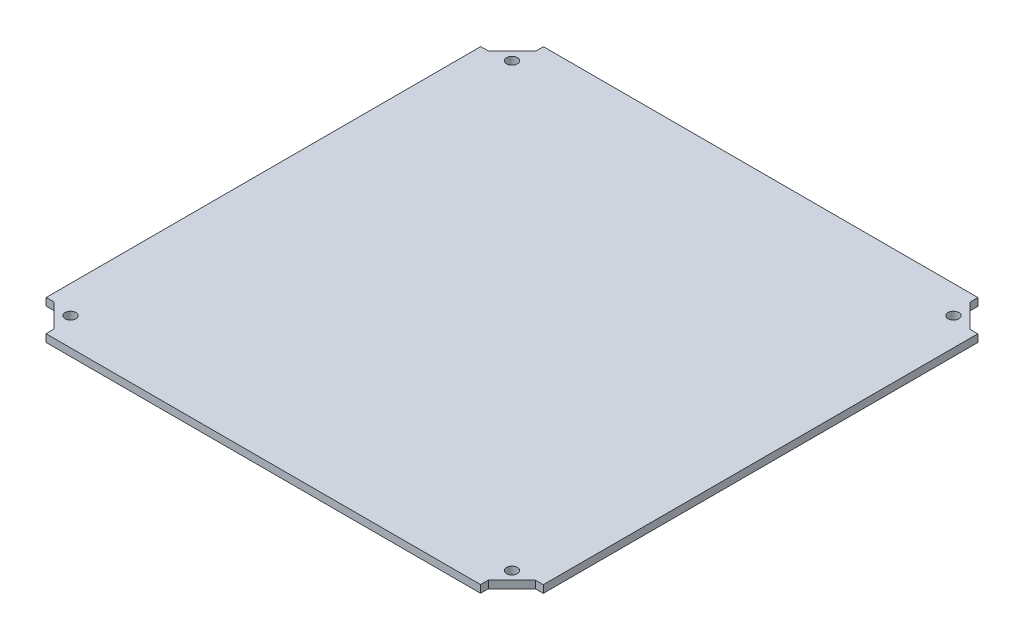
ISO-10303-21;
HEADER;
FILE_DESCRIPTION(('STEP AP214'),'2;1');
FILE_NAME('part.step','',(''),(''),'','','');
FILE_SCHEMA(('AUTOMOTIVE_DESIGN { 1 0 10303 214 1 1 1 1 }'));
ENDSEC;
DATA;
#1=APPLICATION_CONTEXT('core data for automotive mechanical design processes');
#2=APPLICATION_PROTOCOL_DEFINITION('international standard','automotive_design',2000,#1);
#3=PRODUCT_CONTEXT('',#1,'mechanical');
#4=PRODUCT('Part','Part','',(#3));
#5=PRODUCT_RELATED_PRODUCT_CATEGORY('part','',(#4));
#6=PRODUCT_DEFINITION_FORMATION('','',#4);
#7=PRODUCT_DEFINITION_CONTEXT('part definition',#1,'design');
#8=PRODUCT_DEFINITION('design','',#6,#7);
#9=PRODUCT_DEFINITION_SHAPE('','',#8);
#10=(LENGTH_UNIT() NAMED_UNIT(*) SI_UNIT(.MILLI.,.METRE.));
#11=(NAMED_UNIT(*) PLANE_ANGLE_UNIT() SI_UNIT($,.RADIAN.));
#12=(NAMED_UNIT(*) SI_UNIT($,.STERADIAN.) SOLID_ANGLE_UNIT());
#13=UNCERTAINTY_MEASURE_WITH_UNIT(LENGTH_MEASURE(1.E-05),#10,'distance_accuracy_value','');
#14=(GEOMETRIC_REPRESENTATION_CONTEXT(3) GLOBAL_UNCERTAINTY_ASSIGNED_CONTEXT((#13)) GLOBAL_UNIT_ASSIGNED_CONTEXT((#10,
#11,#12)) REPRESENTATION_CONTEXT('',''));
#15=CARTESIAN_POINT('',(0.,0.,0.));
#16=DIRECTION('',(0.,0.,1.));
#17=DIRECTION('',(1.,0.,0.));
#18=AXIS2_PLACEMENT_3D('',#15,#16,#17);
#19=CARTESIAN_POINT('',(0.,3.175,91.2332677458592));
#20=DIRECTION('',(0.,0.,-1.));
#21=DIRECTION('',(-1.,0.,0.));
#22=AXIS2_PLACEMENT_3D('',#19,#20,#21);
#23=PLANE('',#22);
#24=DIRECTION('',(1.,0.,0.));
#25=VECTOR('',#24,1.);
#26=CARTESIAN_POINT('',(0.,0.,91.2332677458592));
#27=LINE('',#26,#25);
#28=CARTESIAN_POINT('',(-104.4575,0.,91.2332677458592));
#29=VERTEX_POINT('',#28);
#30=CARTESIAN_POINT('',(-101.1555,0.,91.2332677458592));
#31=VERTEX_POINT('',#30);
#32=EDGE_CURVE('E191',#29,#31,#27,.T.);
#33=ORIENTED_EDGE('',*,*,#32,.T.);
#34=DIRECTION('',(0.,-1.,0.));
#35=VECTOR('',#34,1.);
#36=CARTESIAN_POINT('',(-101.1555,3.175,91.2332677458592));
#37=LINE('',#36,#35);
#38=CARTESIAN_POINT('',(-101.1555,3.175,91.2332677458592));
#39=VERTEX_POINT('',#38);
#40=EDGE_CURVE('E11',#39,#31,#37,.T.);
#41=ORIENTED_EDGE('',*,*,#40,.F.);
#42=DIRECTION('',(1.,0.,0.));
#43=VECTOR('',#42,1.);
#44=CARTESIAN_POINT('',(0.,3.175,91.2332677458592));
#45=LINE('',#44,#43);
#46=CARTESIAN_POINT('',(-104.4575,3.175,91.2332677458592));
#47=VERTEX_POINT('',#46);
#48=EDGE_CURVE('E249',#47,#39,#45,.T.);
#49=ORIENTED_EDGE('',*,*,#48,.F.);
#50=DIRECTION('',(0.,-1.,0.));
#51=VECTOR('',#50,1.);
#52=CARTESIAN_POINT('',(-104.4575,3.175,91.2332677458592));
#53=LINE('',#52,#51);
#54=EDGE_CURVE('E58',#47,#29,#53,.T.);
#55=ORIENTED_EDGE('',*,*,#54,.T.);
#56=EDGE_LOOP('',(#33,#41,#49,#55));
#57=FACE_BOUND('',#56,.T.);
#58=ADVANCED_FACE('F41',(#57),#23,.F.);
#59=CARTESIAN_POINT('',(-96.6436327647906,3.175,95.7855537941316));
#60=DIRECTION('',(0.710252845679373,0.,-0.703946656504847));
#61=DIRECTION('',(-0.703946656504847,0.,-0.710252845679373));
#62=AXIS2_PLACEMENT_3D('',#59,#60,#61);
#63=PLANE('',#62);
#64=DIRECTION('',(0.703946656504847,0.,0.710252845679373));
#65=VECTOR('',#64,1.);
#66=CARTESIAN_POINT('',(-96.6436327647906,0.,95.7855537941316));
#67=LINE('',#66,#65);
#68=CARTESIAN_POINT('',(-91.3213652086273,0.,101.1555));
#69=VERTEX_POINT('',#68);
#70=EDGE_CURVE('E194',#31,#69,#67,.T.);
#71=ORIENTED_EDGE('',*,*,#70,.T.);
#72=DIRECTION('',(0.,-1.,0.));
#73=VECTOR('',#72,1.);
#74=CARTESIAN_POINT('',(-91.3213652086273,3.175,101.1555));
#75=LINE('',#74,#73);
#76=CARTESIAN_POINT('',(-91.3213652086273,3.175,101.1555));
#77=VERTEX_POINT('',#76);
#78=EDGE_CURVE('E50',#77,#69,#75,.T.);
#79=ORIENTED_EDGE('',*,*,#78,.F.);
#80=DIRECTION('',(0.703946656504847,0.,0.710252845679373));
#81=VECTOR('',#80,1.);
#82=CARTESIAN_POINT('',(-96.6436327647906,3.175,95.7855537941316));
#83=LINE('',#82,#81);
#84=EDGE_CURVE('E120',#39,#77,#83,.T.);
#85=ORIENTED_EDGE('',*,*,#84,.F.);
#86=ORIENTED_EDGE('',*,*,#40,.T.);
#87=EDGE_LOOP('',(#71,#79,#85,#86));
#88=FACE_BOUND('',#87,.T.);
#89=ADVANCED_FACE('F295',(#88),#63,.F.);
#90=CARTESIAN_POINT('',(-91.3213652086273,3.175,0.));
#91=DIRECTION('',(-1.,0.,0.));
#92=DIRECTION('',(0.,0.,1.));
#93=AXIS2_PLACEMENT_3D('',#90,#91,#92);
#94=PLANE('',#93);
#95=DIRECTION('',(0.,0.,-1.));
#96=VECTOR('',#95,1.);
#97=CARTESIAN_POINT('',(-91.3213652086273,0.,0.));
#98=LINE('',#97,#96);
#99=CARTESIAN_POINT('',(-91.3213652086273,0.,104.4575));
#100=VERTEX_POINT('',#99);
#101=EDGE_CURVE('E199',#100,#69,#98,.T.);
#102=ORIENTED_EDGE('',*,*,#101,.F.);
#103=DIRECTION('',(0.,-1.,0.));
#104=VECTOR('',#103,1.);
#105=CARTESIAN_POINT('',(-91.3213652086273,3.175,104.4575));
#106=LINE('',#105,#104);
#107=CARTESIAN_POINT('',(-91.3213652086273,3.175,104.4575));
#108=VERTEX_POINT('',#107);
#109=EDGE_CURVE('E286',#108,#100,#106,.T.);
#110=ORIENTED_EDGE('',*,*,#109,.F.);
#111=DIRECTION('',(0.,0.,-1.));
#112=VECTOR('',#111,1.);
#113=CARTESIAN_POINT('',(-91.3213652086273,3.175,0.));
#114=LINE('',#113,#112);
#115=EDGE_CURVE('E294',#108,#77,#114,.T.);
#116=ORIENTED_EDGE('',*,*,#115,.T.);
#117=ORIENTED_EDGE('',*,*,#78,.T.);
#118=EDGE_LOOP('',(#102,#110,#116,#117));
#119=FACE_BOUND('',#118,.T.);
#120=ADVANCED_FACE('F292',(#119),#94,.T.);
#121=CARTESIAN_POINT('',(0.,3.175,104.4575));
#122=DIRECTION('',(0.,0.,-1.));
#123=DIRECTION('',(-1.,0.,0.));
#124=AXIS2_PLACEMENT_3D('',#121,#122,#123);
#125=PLANE('',#124);
#126=DIRECTION('',(1.,0.,0.));
#127=VECTOR('',#126,1.);
#128=CARTESIAN_POINT('',(0.,0.,104.4575));
#129=LINE('',#128,#127);
#130=CARTESIAN_POINT('',(91.2332677458592,0.,104.4575));
#131=VERTEX_POINT('',#130);
#132=EDGE_CURVE('E203',#100,#131,#129,.T.);
#133=ORIENTED_EDGE('',*,*,#132,.T.);
#134=DIRECTION('',(0.,-1.,0.));
#135=VECTOR('',#134,1.);
#136=CARTESIAN_POINT('',(91.2332677458592,3.175,104.4575));
#137=LINE('',#136,#135);
#138=CARTESIAN_POINT('',(91.2332677458592,3.175,104.4575));
#139=VERTEX_POINT('',#138);
#140=EDGE_CURVE('E282',#139,#131,#137,.T.);
#141=ORIENTED_EDGE('',*,*,#140,.F.);
#142=DIRECTION('',(1.,0.,0.));
#143=VECTOR('',#142,1.);
#144=CARTESIAN_POINT('',(0.,3.175,104.4575));
#145=LINE('',#144,#143);
#146=EDGE_CURVE('E314',#108,#139,#145,.T.);
#147=ORIENTED_EDGE('',*,*,#146,.F.);
#148=ORIENTED_EDGE('',*,*,#109,.T.);
#149=EDGE_LOOP('',(#133,#141,#147,#148));
#150=FACE_BOUND('',#149,.T.);
#151=ADVANCED_FACE('F304',(#150),#125,.F.);
#152=CARTESIAN_POINT('',(91.2332677458592,3.175,0.));
#153=DIRECTION('',(-1.,0.,0.));
#154=DIRECTION('',(0.,0.,1.));
#155=AXIS2_PLACEMENT_3D('',#152,#153,#154);
#156=PLANE('',#155);
#157=DIRECTION('',(0.,0.,-1.));
#158=VECTOR('',#157,1.);
#159=CARTESIAN_POINT('',(91.2332677458592,0.,0.));
#160=LINE('',#159,#158);
#161=CARTESIAN_POINT('',(91.2332677458592,0.,101.1555));
#162=VERTEX_POINT('',#161);
#163=EDGE_CURVE('E206',#131,#162,#160,.T.);
#164=ORIENTED_EDGE('',*,*,#163,.T.);
#165=DIRECTION('',(0.,-1.,0.));
#166=VECTOR('',#165,1.);
#167=CARTESIAN_POINT('',(91.2332677458592,3.175,101.1555));
#168=LINE('',#167,#166);
#169=CARTESIAN_POINT('',(91.2332677458592,3.175,101.1555));
#170=VERTEX_POINT('',#169);
#171=EDGE_CURVE('E278',#170,#162,#168,.T.);
#172=ORIENTED_EDGE('',*,*,#171,.F.);
#173=DIRECTION('',(0.,0.,-1.));
#174=VECTOR('',#173,1.);
#175=CARTESIAN_POINT('',(91.2332677458592,3.175,0.));
#176=LINE('',#175,#174);
#177=EDGE_CURVE('E310',#139,#170,#176,.T.);
#178=ORIENTED_EDGE('',*,*,#177,.F.);
#179=ORIENTED_EDGE('',*,*,#140,.T.);
#180=EDGE_LOOP('',(#164,#172,#178,#179));
#181=FACE_BOUND('',#180,.T.);
#182=ADVANCED_FACE('F308',(#181),#156,.F.);
#183=CARTESIAN_POINT('',(95.7855537941315,3.175,96.6436327647906));
#184=DIRECTION('',(-0.703946656504847,0.,-0.710252845679373));
#185=DIRECTION('',(-0.710252845679373,0.,0.703946656504847));
#186=AXIS2_PLACEMENT_3D('',#183,#184,#185);
#187=PLANE('',#186);
#188=DIRECTION('',(0.710252845679373,0.,-0.703946656504847));
#189=VECTOR('',#188,1.);
#190=CARTESIAN_POINT('',(95.7855537941315,0.,96.6436327647906));
#191=LINE('',#190,#189);
#192=CARTESIAN_POINT('',(101.1555,0.,91.3213652086273));
#193=VERTEX_POINT('',#192);
#194=EDGE_CURVE('E209',#162,#193,#191,.T.);
#195=ORIENTED_EDGE('',*,*,#194,.T.);
#196=DIRECTION('',(0.,-1.,0.));
#197=VECTOR('',#196,1.);
#198=CARTESIAN_POINT('',(101.1555,3.175,91.3213652086273));
#199=LINE('',#198,#197);
#200=CARTESIAN_POINT('',(101.1555,3.175,91.3213652086273));
#201=VERTEX_POINT('',#200);
#202=EDGE_CURVE('E275',#201,#193,#199,.T.);
#203=ORIENTED_EDGE('',*,*,#202,.F.);
#204=DIRECTION('',(0.710252845679373,0.,-0.703946656504847));
#205=VECTOR('',#204,1.);
#206=CARTESIAN_POINT('',(95.7855537941315,3.175,96.6436327647906));
#207=LINE('',#206,#205);
#208=EDGE_CURVE('E313',#170,#201,#207,.T.);
#209=ORIENTED_EDGE('',*,*,#208,.F.);
#210=ORIENTED_EDGE('',*,*,#171,.T.);
#211=EDGE_LOOP('',(#195,#203,#209,#210));
#212=FACE_BOUND('',#211,.T.);
#213=ADVANCED_FACE('F564',(#212),#187,.F.);
#214=CARTESIAN_POINT('',(0.,3.175,91.3213652086273));
#215=DIRECTION('',(0.,0.,1.));
#216=DIRECTION('',(1.,0.,0.));
#217=AXIS2_PLACEMENT_3D('',#214,#215,#216);
#218=PLANE('',#217);
#219=DIRECTION('',(-1.,0.,0.));
#220=VECTOR('',#219,1.);
#221=CARTESIAN_POINT('',(0.,0.,91.3213652086273));
#222=LINE('',#221,#220);
#223=CARTESIAN_POINT('',(104.4575,0.,91.3213652086273));
#224=VERTEX_POINT('',#223);
#225=EDGE_CURVE('E213',#224,#193,#222,.T.);
#226=ORIENTED_EDGE('',*,*,#225,.F.);
#227=DIRECTION('',(0.,-1.,0.));
#228=VECTOR('',#227,1.);
#229=CARTESIAN_POINT('',(104.4575,3.175,91.3213652086273));
#230=LINE('',#229,#228);
#231=CARTESIAN_POINT('',(104.4575,3.175,91.3213652086273));
#232=VERTEX_POINT('',#231);
#233=EDGE_CURVE('E272',#232,#224,#230,.T.);
#234=ORIENTED_EDGE('',*,*,#233,.F.);
#235=DIRECTION('',(-1.,0.,0.));
#236=VECTOR('',#235,1.);
#237=CARTESIAN_POINT('',(0.,3.175,91.3213652086273));
#238=LINE('',#237,#236);
#239=EDGE_CURVE('E318',#232,#201,#238,.T.);
#240=ORIENTED_EDGE('',*,*,#239,.T.);
#241=ORIENTED_EDGE('',*,*,#202,.T.);
#242=EDGE_LOOP('',(#226,#234,#240,#241));
#243=FACE_BOUND('',#242,.T.);
#244=ADVANCED_FACE('F554',(#243),#218,.T.);
#245=CARTESIAN_POINT('',(104.4575,3.175,0.));
#246=DIRECTION('',(-1.,0.,0.));
#247=DIRECTION('',(0.,0.,1.));
#248=AXIS2_PLACEMENT_3D('',#245,#246,#247);
#249=PLANE('',#248);
#250=DIRECTION('',(0.,0.,-1.));
#251=VECTOR('',#250,1.);
#252=CARTESIAN_POINT('',(104.4575,0.,0.));
#253=LINE('',#252,#251);
#254=CARTESIAN_POINT('',(104.4575,0.,-91.2332677458592));
#255=VERTEX_POINT('',#254);
#256=EDGE_CURVE('E217',#224,#255,#253,.T.);
#257=ORIENTED_EDGE('',*,*,#256,.T.);
#258=DIRECTION('',(0.,-1.,0.));
#259=VECTOR('',#258,1.);
#260=CARTESIAN_POINT('',(104.4575,3.175,-91.2332677458592));
#261=LINE('',#260,#259);
#262=CARTESIAN_POINT('',(104.4575,3.175,-91.2332677458592));
#263=VERTEX_POINT('',#262);
#264=EDGE_CURVE('E268',#263,#255,#261,.T.);
#265=ORIENTED_EDGE('',*,*,#264,.F.);
#266=DIRECTION('',(0.,0.,-1.));
#267=VECTOR('',#266,1.);
#268=CARTESIAN_POINT('',(104.4575,3.175,0.));
#269=LINE('',#268,#267);
#270=EDGE_CURVE('E326',#232,#263,#269,.T.);
#271=ORIENTED_EDGE('',*,*,#270,.F.);
#272=ORIENTED_EDGE('',*,*,#233,.T.);
#273=EDGE_LOOP('',(#257,#265,#271,#272));
#274=FACE_BOUND('',#273,.T.);
#275=ADVANCED_FACE('F544',(#274),#249,.F.);
#276=CARTESIAN_POINT('',(0.,3.175,-91.2332677458592));
#277=DIRECTION('',(0.,0.,1.));
#278=DIRECTION('',(1.,0.,0.));
#279=AXIS2_PLACEMENT_3D('',#276,#277,#278);
#280=PLANE('',#279);
#281=DIRECTION('',(-1.,0.,0.));
#282=VECTOR('',#281,1.);
#283=CARTESIAN_POINT('',(0.,0.,-91.2332677458592));
#284=LINE('',#283,#282);
#285=CARTESIAN_POINT('',(101.1555,0.,-91.2332677458592));
#286=VERTEX_POINT('',#285);
#287=EDGE_CURVE('E220',#255,#286,#284,.T.);
#288=ORIENTED_EDGE('',*,*,#287,.T.);
#289=DIRECTION('',(0.,-1.,0.));
#290=VECTOR('',#289,1.);
#291=CARTESIAN_POINT('',(101.1555,3.175,-91.2332677458592));
#292=LINE('',#291,#290);
#293=CARTESIAN_POINT('',(101.1555,3.175,-91.2332677458592));
#294=VERTEX_POINT('',#293);
#295=EDGE_CURVE('E265',#294,#286,#292,.T.);
#296=ORIENTED_EDGE('',*,*,#295,.F.);
#297=DIRECTION('',(-1.,0.,0.));
#298=VECTOR('',#297,1.);
#299=CARTESIAN_POINT('',(0.,3.175,-91.2332677458592));
#300=LINE('',#299,#298);
#301=EDGE_CURVE('E329',#263,#294,#300,.T.);
#302=ORIENTED_EDGE('',*,*,#301,.F.);
#303=ORIENTED_EDGE('',*,*,#264,.T.);
#304=EDGE_LOOP('',(#288,#296,#302,#303));
#305=FACE_BOUND('',#304,.T.);
#306=ADVANCED_FACE('F534',(#305),#280,.F.);
#307=CARTESIAN_POINT('',(96.6436327647906,3.175,-95.7855537941315));
#308=DIRECTION('',(0.710252845679373,0.,-0.703946656504847));
#309=DIRECTION('',(-0.703946656504847,0.,-0.710252845679373));
#310=AXIS2_PLACEMENT_3D('',#307,#308,#309);
#311=PLANE('',#310);
#312=DIRECTION('',(0.703946656504847,0.,0.710252845679373));
#313=VECTOR('',#312,1.);
#314=CARTESIAN_POINT('',(96.6436327647906,0.,-95.7855537941315));
#315=LINE('',#314,#313);
#316=CARTESIAN_POINT('',(91.3213652086273,0.,-101.1555));
#317=VERTEX_POINT('',#316);
#318=EDGE_CURVE('E224',#317,#286,#315,.T.);
#319=ORIENTED_EDGE('',*,*,#318,.F.);
#320=DIRECTION('',(0.,-1.,0.));
#321=VECTOR('',#320,1.);
#322=CARTESIAN_POINT('',(91.3213652086273,3.175,-101.1555));
#323=LINE('',#322,#321);
#324=CARTESIAN_POINT('',(91.3213652086273,3.175,-101.1555));
#325=VERTEX_POINT('',#324);
#326=EDGE_CURVE('E262',#325,#317,#323,.T.);
#327=ORIENTED_EDGE('',*,*,#326,.F.);
#328=DIRECTION('',(0.703946656504847,0.,0.710252845679373));
#329=VECTOR('',#328,1.);
#330=CARTESIAN_POINT('',(96.6436327647906,3.175,-95.7855537941315));
#331=LINE('',#330,#329);
#332=EDGE_CURVE('E332',#325,#294,#331,.T.);
#333=ORIENTED_EDGE('',*,*,#332,.T.);
#334=ORIENTED_EDGE('',*,*,#295,.T.);
#335=EDGE_LOOP('',(#319,#327,#333,#334));
#336=FACE_BOUND('',#335,.T.);
#337=ADVANCED_FACE('F525',(#336),#311,.T.);
#338=CARTESIAN_POINT('',(91.3213652086273,3.175,0.));
#339=DIRECTION('',(1.,0.,0.));
#340=DIRECTION('',(0.,0.,-1.));
#341=AXIS2_PLACEMENT_3D('',#338,#339,#340);
#342=PLANE('',#341);
#343=DIRECTION('',(0.,0.,1.));
#344=VECTOR('',#343,1.);
#345=CARTESIAN_POINT('',(91.3213652086273,0.,0.));
#346=LINE('',#345,#344);
#347=CARTESIAN_POINT('',(91.3213652086273,0.,-104.4575));
#348=VERTEX_POINT('',#347);
#349=EDGE_CURVE('E228',#348,#317,#346,.T.);
#350=ORIENTED_EDGE('',*,*,#349,.F.);
#351=DIRECTION('',(0.,-1.,0.));
#352=VECTOR('',#351,1.);
#353=CARTESIAN_POINT('',(91.3213652086273,3.175,-104.4575));
#354=LINE('',#353,#352);
#355=CARTESIAN_POINT('',(91.3213652086273,3.175,-104.4575));
#356=VERTEX_POINT('',#355);
#357=EDGE_CURVE('E259',#356,#348,#354,.T.);
#358=ORIENTED_EDGE('',*,*,#357,.F.);
#359=DIRECTION('',(0.,0.,1.));
#360=VECTOR('',#359,1.);
#361=CARTESIAN_POINT('',(91.3213652086273,3.175,0.));
#362=LINE('',#361,#360);
#363=EDGE_CURVE('E336',#356,#325,#362,.T.);
#364=ORIENTED_EDGE('',*,*,#363,.T.);
#365=ORIENTED_EDGE('',*,*,#326,.T.);
#366=EDGE_LOOP('',(#350,#358,#364,#365));
#367=FACE_BOUND('',#366,.T.);
#368=ADVANCED_FACE('F351',(#367),#342,.T.);
#369=CARTESIAN_POINT('',(0.,3.175,-104.4575));
#370=DIRECTION('',(0.,0.,-1.));
#371=DIRECTION('',(-1.,0.,0.));
#372=AXIS2_PLACEMENT_3D('',#369,#370,#371);
#373=PLANE('',#372);
#374=DIRECTION('',(1.,0.,0.));
#375=VECTOR('',#374,1.);
#376=CARTESIAN_POINT('',(0.,0.,-104.4575));
#377=LINE('',#376,#375);
#378=CARTESIAN_POINT('',(-91.2332677458592,0.,-104.4575));
#379=VERTEX_POINT('',#378);
#380=EDGE_CURVE('E232',#379,#348,#377,.T.);
#381=ORIENTED_EDGE('',*,*,#380,.F.);
#382=DIRECTION('',(0.,-1.,0.));
#383=VECTOR('',#382,1.);
#384=CARTESIAN_POINT('',(-91.2332677458592,3.175,-104.4575));
#385=LINE('',#384,#383);
#386=CARTESIAN_POINT('',(-91.2332677458592,3.175,-104.4575));
#387=VERTEX_POINT('',#386);
#388=EDGE_CURVE('E256',#387,#379,#385,.T.);
#389=ORIENTED_EDGE('',*,*,#388,.F.);
#390=DIRECTION('',(1.,0.,0.));
#391=VECTOR('',#390,1.);
#392=CARTESIAN_POINT('',(0.,3.175,-104.4575));
#393=LINE('',#392,#391);
#394=EDGE_CURVE('E340',#387,#356,#393,.T.);
#395=ORIENTED_EDGE('',*,*,#394,.T.);
#396=ORIENTED_EDGE('',*,*,#357,.T.);
#397=EDGE_LOOP('',(#381,#389,#395,#396));
#398=FACE_BOUND('',#397,.T.);
#399=ADVANCED_FACE('F346',(#398),#373,.T.);
#400=CARTESIAN_POINT('',(-91.2332677458592,3.175,0.));
#401=DIRECTION('',(1.,0.,0.));
#402=DIRECTION('',(0.,0.,-1.));
#403=AXIS2_PLACEMENT_3D('',#400,#401,#402);
#404=PLANE('',#403);
#405=DIRECTION('',(0.,0.,1.));
#406=VECTOR('',#405,1.);
#407=CARTESIAN_POINT('',(-91.2332677458592,0.,0.));
#408=LINE('',#407,#406);
#409=CARTESIAN_POINT('',(-91.2332677458592,0.,-101.1555));
#410=VERTEX_POINT('',#409);
#411=EDGE_CURVE('E236',#379,#410,#408,.T.);
#412=ORIENTED_EDGE('',*,*,#411,.T.);
#413=DIRECTION('',(0.,-1.,0.));
#414=VECTOR('',#413,1.);
#415=CARTESIAN_POINT('',(-91.2332677458592,3.175,-101.1555));
#416=LINE('',#415,#414);
#417=CARTESIAN_POINT('',(-91.2332677458592,3.175,-101.1555));
#418=VERTEX_POINT('',#417);
#419=EDGE_CURVE('E170',#418,#410,#416,.T.);
#420=ORIENTED_EDGE('',*,*,#419,.F.);
#421=DIRECTION('',(0.,0.,1.));
#422=VECTOR('',#421,1.);
#423=CARTESIAN_POINT('',(-91.2332677458592,3.175,0.));
#424=LINE('',#423,#422);
#425=EDGE_CURVE('E179',#387,#418,#424,.T.);
#426=ORIENTED_EDGE('',*,*,#425,.F.);
#427=ORIENTED_EDGE('',*,*,#388,.T.);
#428=EDGE_LOOP('',(#412,#420,#426,#427));
#429=FACE_BOUND('',#428,.T.);
#430=ADVANCED_FACE('F355',(#429),#404,.F.);
#431=CARTESIAN_POINT('',(-95.7855537941315,3.175,-96.6436327647906));
#432=DIRECTION('',(-0.703946656504847,0.,-0.710252845679373));
#433=DIRECTION('',(-0.710252845679373,0.,0.703946656504847));
#434=AXIS2_PLACEMENT_3D('',#431,#432,#433);
#435=PLANE('',#434);
#436=DIRECTION('',(0.710252845679373,0.,-0.703946656504847));
#437=VECTOR('',#436,1.);
#438=CARTESIAN_POINT('',(-95.7855537941315,0.,-96.6436327647906));
#439=LINE('',#438,#437);
#440=CARTESIAN_POINT('',(-101.1555,0.,-91.3213652086273));
#441=VERTEX_POINT('',#440);
#442=EDGE_CURVE('E165',#441,#410,#439,.T.);
#443=ORIENTED_EDGE('',*,*,#442,.F.);
#444=DIRECTION('',(0.,-1.,0.));
#445=VECTOR('',#444,1.);
#446=CARTESIAN_POINT('',(-101.1555,3.175,-91.3213652086273));
#447=LINE('',#446,#445);
#448=CARTESIAN_POINT('',(-101.1555,3.175,-91.3213652086273));
#449=VERTEX_POINT('',#448);
#450=EDGE_CURVE('E160',#449,#441,#447,.T.);
#451=ORIENTED_EDGE('',*,*,#450,.F.);
#452=DIRECTION('',(0.710252845679373,0.,-0.703946656504847));
#453=VECTOR('',#452,1.);
#454=CARTESIAN_POINT('',(-95.7855537941315,3.175,-96.6436327647906));
#455=LINE('',#454,#453);
#456=EDGE_CURVE('E163',#449,#418,#455,.T.);
#457=ORIENTED_EDGE('',*,*,#456,.T.);
#458=ORIENTED_EDGE('',*,*,#419,.T.);
#459=EDGE_LOOP('',(#443,#451,#457,#458));
#460=FACE_BOUND('',#459,.T.);
#461=ADVANCED_FACE('F162',(#460),#435,.T.);
#462=CARTESIAN_POINT('',(0.,3.175,-91.3213652086273));
#463=DIRECTION('',(0.,0.,-1.));
#464=DIRECTION('',(-1.,0.,0.));
#465=AXIS2_PLACEMENT_3D('',#462,#463,#464);
#466=PLANE('',#465);
#467=DIRECTION('',(1.,0.,0.));
#468=VECTOR('',#467,1.);
#469=CARTESIAN_POINT('',(0.,0.,-91.3213652086273));
#470=LINE('',#469,#468);
#471=CARTESIAN_POINT('',(-104.4575,0.,-91.3213652086273));
#472=VERTEX_POINT('',#471);
#473=EDGE_CURVE('E242',#472,#441,#470,.T.);
#474=ORIENTED_EDGE('',*,*,#473,.F.);
#475=DIRECTION('',(0.,-1.,0.));
#476=VECTOR('',#475,1.);
#477=CARTESIAN_POINT('',(-104.4575,3.175,-91.3213652086273));
#478=LINE('',#477,#476);
#479=CARTESIAN_POINT('',(-104.4575,3.175,-91.3213652086273));
#480=VERTEX_POINT('',#479);
#481=EDGE_CURVE('E108',#480,#472,#478,.T.);
#482=ORIENTED_EDGE('',*,*,#481,.F.);
#483=DIRECTION('',(1.,0.,0.));
#484=VECTOR('',#483,1.);
#485=CARTESIAN_POINT('',(0.,3.175,-91.3213652086273));
#486=LINE('',#485,#484);
#487=EDGE_CURVE('E176',#480,#449,#486,.T.);
#488=ORIENTED_EDGE('',*,*,#487,.T.);
#489=ORIENTED_EDGE('',*,*,#450,.T.);
#490=EDGE_LOOP('',(#474,#482,#488,#489));
#491=FACE_BOUND('',#490,.T.);
#492=ADVANCED_FACE('F183',(#491),#466,.T.);
#493=CARTESIAN_POINT('',(-104.4575,3.175,0.));
#494=DIRECTION('',(-1.,0.,0.));
#495=DIRECTION('',(0.,0.,1.));
#496=AXIS2_PLACEMENT_3D('',#493,#494,#495);
#497=PLANE('',#496);
#498=DIRECTION('',(0.,0.,-1.));
#499=VECTOR('',#498,1.);
#500=CARTESIAN_POINT('',(-104.4575,0.,0.));
#501=LINE('',#500,#499);
#502=EDGE_CURVE('E245',#29,#472,#501,.T.);
#503=ORIENTED_EDGE('',*,*,#502,.F.);
#504=ORIENTED_EDGE('',*,*,#54,.F.);
#505=DIRECTION('',(0.,0.,-1.));
#506=VECTOR('',#505,1.);
#507=CARTESIAN_POINT('',(-104.4575,3.175,0.));
#508=LINE('',#507,#506);
#509=EDGE_CURVE('E185',#47,#480,#508,.T.);
#510=ORIENTED_EDGE('',*,*,#509,.T.);
#511=ORIENTED_EDGE('',*,*,#481,.T.);
#512=EDGE_LOOP('',(#503,#504,#510,#511));
#513=FACE_BOUND('',#512,.T.);
#514=ADVANCED_FACE('F368',(#513),#497,.T.);
#515=CARTESIAN_POINT('',(0.,3.175,0.));
#516=DIRECTION('',(0.,1.,0.));
#517=DIRECTION('',(0.,0.,1.));
#518=AXIS2_PLACEMENT_3D('',#515,#516,#517);
#519=PLANE('',#518);
#520=CARTESIAN_POINT('',(-92.73413,3.175,92.73413));
#521=DIRECTION('',(0.,1.,0.));
#522=DIRECTION('',(0.,0.,1.));
#523=AXIS2_PLACEMENT_3D('',#520,#521,#522);
#524=CIRCLE('',#523,2.28599999999999);
#525=CARTESIAN_POINT('',(-92.73413,3.175,95.02013));
#526=VERTEX_POINT('',#525);
#527=EDGE_CURVE('E420',#526,#526,#524,.T.);
#528=ORIENTED_EDGE('',*,*,#527,.F.);
#529=EDGE_LOOP('',(#528));
#530=FACE_BOUND('',#529,.T.);
#531=CARTESIAN_POINT('',(92.73413,3.175,92.73413));
#532=DIRECTION('',(0.,1.,0.));
#533=DIRECTION('',(0.,0.,1.));
#534=AXIS2_PLACEMENT_3D('',#531,#532,#533);
#535=CIRCLE('',#534,2.28599999999999);
#536=CARTESIAN_POINT('',(92.73413,3.175,95.02013));
#537=VERTEX_POINT('',#536);
#538=EDGE_CURVE('E408',#537,#537,#535,.T.);
#539=ORIENTED_EDGE('',*,*,#538,.F.);
#540=EDGE_LOOP('',(#539));
#541=FACE_BOUND('',#540,.T.);
#542=CARTESIAN_POINT('',(92.73413,3.175,-92.73413));
#543=DIRECTION('',(0.,1.,0.));
#544=DIRECTION('',(0.,0.,1.));
#545=AXIS2_PLACEMENT_3D('',#542,#543,#544);
#546=CIRCLE('',#545,2.28599999999999);
#547=CARTESIAN_POINT('',(92.73413,3.175,-90.44813));
#548=VERTEX_POINT('',#547);
#549=EDGE_CURVE('E402',#548,#548,#546,.T.);
#550=ORIENTED_EDGE('',*,*,#549,.F.);
#551=EDGE_LOOP('',(#550));
#552=FACE_BOUND('',#551,.T.);
#553=CARTESIAN_POINT('',(-92.73413,3.175,-92.73413));
#554=DIRECTION('',(0.,1.,0.));
#555=DIRECTION('',(0.,0.,1.));
#556=AXIS2_PLACEMENT_3D('',#553,#554,#555);
#557=CIRCLE('',#556,2.28599999999999);
#558=CARTESIAN_POINT('',(-92.73413,3.175,-90.44813));
#559=VERTEX_POINT('',#558);
#560=EDGE_CURVE('E412',#559,#559,#557,.T.);
#561=ORIENTED_EDGE('',*,*,#560,.F.);
#562=EDGE_LOOP('',(#561));
#563=FACE_BOUND('',#562,.T.);
#564=ORIENTED_EDGE('',*,*,#48,.T.);
#565=ORIENTED_EDGE('',*,*,#84,.T.);
#566=ORIENTED_EDGE('',*,*,#115,.F.);
#567=ORIENTED_EDGE('',*,*,#146,.T.);
#568=ORIENTED_EDGE('',*,*,#177,.T.);
#569=ORIENTED_EDGE('',*,*,#208,.T.);
#570=ORIENTED_EDGE('',*,*,#239,.F.);
#571=ORIENTED_EDGE('',*,*,#270,.T.);
#572=ORIENTED_EDGE('',*,*,#301,.T.);
#573=ORIENTED_EDGE('',*,*,#332,.F.);
#574=ORIENTED_EDGE('',*,*,#363,.F.);
#575=ORIENTED_EDGE('',*,*,#394,.F.);
#576=ORIENTED_EDGE('',*,*,#425,.T.);
#577=ORIENTED_EDGE('',*,*,#456,.F.);
#578=ORIENTED_EDGE('',*,*,#487,.F.);
#579=ORIENTED_EDGE('',*,*,#509,.F.);
#580=EDGE_LOOP('',(#564,#565,#566,#567,#568,#569,#570,#571,#572,#573,#574,#575,#576,#577,#578,#579));
#581=FACE_BOUND('',#580,.T.);
#582=ADVANCED_FACE('F174',(#530,#541,#552,#563,#581),#519,.T.);
#583=CARTESIAN_POINT('',(0.,0.,0.));
#584=DIRECTION('',(0.,1.,0.));
#585=DIRECTION('',(0.,0.,1.));
#586=AXIS2_PLACEMENT_3D('',#583,#584,#585);
#587=PLANE('',#586);
#588=CARTESIAN_POINT('',(-92.73413,0.,92.73413));
#589=DIRECTION('',(0.,1.,0.));
#590=DIRECTION('',(0.,0.,1.));
#591=AXIS2_PLACEMENT_3D('',#588,#589,#590);
#592=CIRCLE('',#591,2.28599999999999);
#593=CARTESIAN_POINT('',(-92.73413,0.,95.02013));
#594=VERTEX_POINT('',#593);
#595=EDGE_CURVE('E422',#594,#594,#592,.F.);
#596=ORIENTED_EDGE('',*,*,#595,.F.);
#597=EDGE_LOOP('',(#596));
#598=FACE_BOUND('',#597,.T.);
#599=CARTESIAN_POINT('',(92.73413,0.,92.73413));
#600=DIRECTION('',(0.,1.,0.));
#601=DIRECTION('',(0.,0.,1.));
#602=AXIS2_PLACEMENT_3D('',#599,#600,#601);
#603=CIRCLE('',#602,2.28599999999999);
#604=CARTESIAN_POINT('',(92.73413,0.,95.02013));
#605=VERTEX_POINT('',#604);
#606=EDGE_CURVE('E415',#605,#605,#603,.F.);
#607=ORIENTED_EDGE('',*,*,#606,.F.);
#608=EDGE_LOOP('',(#607));
#609=FACE_BOUND('',#608,.T.);
#610=CARTESIAN_POINT('',(92.73413,0.,-92.73413));
#611=DIRECTION('',(0.,1.,0.));
#612=DIRECTION('',(0.,0.,1.));
#613=AXIS2_PLACEMENT_3D('',#610,#611,#612);
#614=CIRCLE('',#613,2.28599999999999);
#615=CARTESIAN_POINT('',(92.73413,0.,-90.44813));
#616=VERTEX_POINT('',#615);
#617=EDGE_CURVE('E405',#616,#616,#614,.F.);
#618=ORIENTED_EDGE('',*,*,#617,.F.);
#619=EDGE_LOOP('',(#618));
#620=FACE_BOUND('',#619,.T.);
#621=CARTESIAN_POINT('',(-92.73413,0.,-92.73413));
#622=DIRECTION('',(0.,1.,0.));
#623=DIRECTION('',(0.,0.,1.));
#624=AXIS2_PLACEMENT_3D('',#621,#622,#623);
#625=CIRCLE('',#624,2.28599999999999);
#626=CARTESIAN_POINT('',(-92.73413,0.,-90.44813));
#627=VERTEX_POINT('',#626);
#628=EDGE_CURVE('E195',#627,#627,#625,.F.);
#629=ORIENTED_EDGE('',*,*,#628,.F.);
#630=EDGE_LOOP('',(#629));
#631=FACE_BOUND('',#630,.T.);
#632=ORIENTED_EDGE('',*,*,#32,.F.);
#633=ORIENTED_EDGE('',*,*,#502,.T.);
#634=ORIENTED_EDGE('',*,*,#473,.T.);
#635=ORIENTED_EDGE('',*,*,#442,.T.);
#636=ORIENTED_EDGE('',*,*,#411,.F.);
#637=ORIENTED_EDGE('',*,*,#380,.T.);
#638=ORIENTED_EDGE('',*,*,#349,.T.);
#639=ORIENTED_EDGE('',*,*,#318,.T.);
#640=ORIENTED_EDGE('',*,*,#287,.F.);
#641=ORIENTED_EDGE('',*,*,#256,.F.);
#642=ORIENTED_EDGE('',*,*,#225,.T.);
#643=ORIENTED_EDGE('',*,*,#194,.F.);
#644=ORIENTED_EDGE('',*,*,#163,.F.);
#645=ORIENTED_EDGE('',*,*,#132,.F.);
#646=ORIENTED_EDGE('',*,*,#101,.T.);
#647=ORIENTED_EDGE('',*,*,#70,.F.);
#648=EDGE_LOOP('',(#632,#633,#634,#635,#636,#637,#638,#639,#640,#641,#642,#643,#644,#645,#646,#647));
#649=FACE_BOUND('',#648,.T.);
#650=ADVANCED_FACE('F299',(#598,#609,#620,#631,#649),#587,.F.);
#651=CARTESIAN_POINT('',(-92.73413,-0.00100000000000013,-92.73413));
#652=DIRECTION('',(0.,1.,0.));
#653=DIRECTION('',(0.,0.,1.));
#654=AXIS2_PLACEMENT_3D('',#651,#652,#653);
#655=CYLINDRICAL_SURFACE('',#654,2.28599999999999);
#656=ORIENTED_EDGE('',*,*,#560,.T.);
#657=EDGE_LOOP('',(#656));
#658=FACE_BOUND('',#657,.T.);
#659=ORIENTED_EDGE('',*,*,#628,.T.);
#660=EDGE_LOOP('',(#659));
#661=FACE_BOUND('',#660,.T.);
#662=ADVANCED_FACE('F380',(#658,#661),#655,.F.);
#663=CARTESIAN_POINT('',(92.73413,-0.00100000000000013,-92.73413));
#664=DIRECTION('',(0.,1.,0.));
#665=DIRECTION('',(0.,0.,1.));
#666=AXIS2_PLACEMENT_3D('',#663,#664,#665);
#667=CYLINDRICAL_SURFACE('',#666,2.28599999999999);
#668=ORIENTED_EDGE('',*,*,#549,.T.);
#669=EDGE_LOOP('',(#668));
#670=FACE_BOUND('',#669,.T.);
#671=ORIENTED_EDGE('',*,*,#617,.T.);
#672=EDGE_LOOP('',(#671));
#673=FACE_BOUND('',#672,.T.);
#674=ADVANCED_FACE('F385',(#670,#673),#667,.F.);
#675=CARTESIAN_POINT('',(92.73413,-0.00100000000000013,92.73413));
#676=DIRECTION('',(0.,1.,0.));
#677=DIRECTION('',(0.,0.,1.));
#678=AXIS2_PLACEMENT_3D('',#675,#676,#677);
#679=CYLINDRICAL_SURFACE('',#678,2.28599999999999);
#680=ORIENTED_EDGE('',*,*,#538,.T.);
#681=EDGE_LOOP('',(#680));
#682=FACE_BOUND('',#681,.T.);
#683=ORIENTED_EDGE('',*,*,#606,.T.);
#684=EDGE_LOOP('',(#683));
#685=FACE_BOUND('',#684,.T.);
#686=ADVANCED_FACE('F390',(#682,#685),#679,.F.);
#687=CARTESIAN_POINT('',(-92.73413,-0.00100000000000013,92.73413));
#688=DIRECTION('',(0.,1.,0.));
#689=DIRECTION('',(0.,0.,1.));
#690=AXIS2_PLACEMENT_3D('',#687,#688,#689);
#691=CYLINDRICAL_SURFACE('',#690,2.28599999999999);
#692=ORIENTED_EDGE('',*,*,#527,.T.);
#693=EDGE_LOOP('',(#692));
#694=FACE_BOUND('',#693,.T.);
#695=ORIENTED_EDGE('',*,*,#595,.T.);
#696=EDGE_LOOP('',(#695));
#697=FACE_BOUND('',#696,.T.);
#698=ADVANCED_FACE('F387',(#694,#697),#691,.F.);
#699=CLOSED_SHELL('',(#58,#89,#120,#151,#182,#213,#244,#275,#306,#337,#368,#399,#430,#461,#492,
#514,#582,#650,#662,#674,#686,#698));
#700=MANIFOLD_SOLID_BREP('B2',#699);
#701=ADVANCED_BREP_SHAPE_REPRESENTATION('',(#18,#700),#14);
#702=SHAPE_DEFINITION_REPRESENTATION(#9,#701);
ENDSEC;
END-ISO-10303-21;
